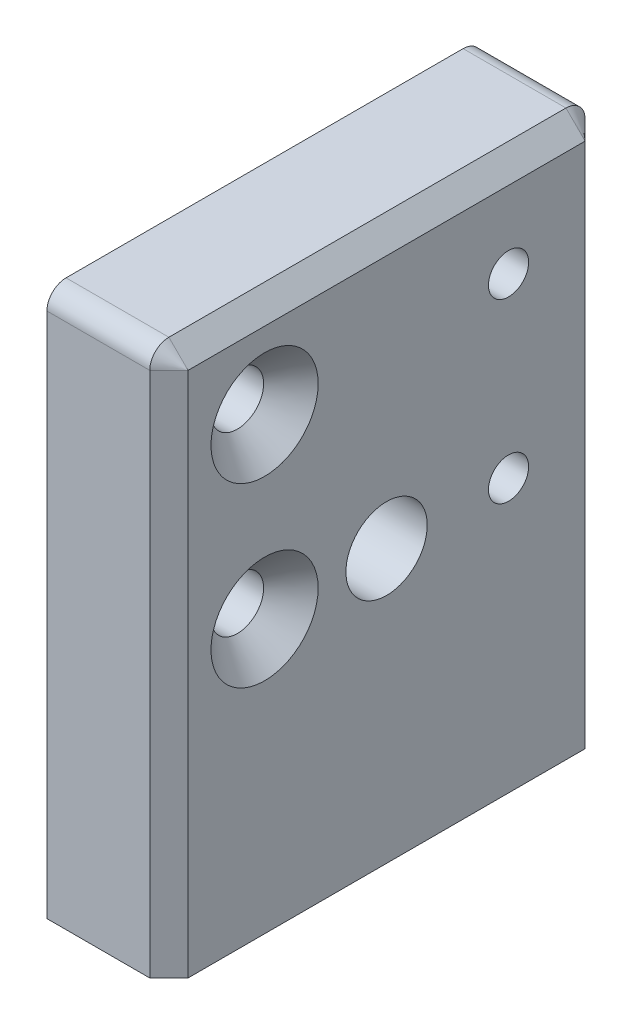
ISO-10303-21;
HEADER;
FILE_DESCRIPTION(('STEP AP214'),'2;1');
FILE_NAME('part.step','',(''),(''),'','','');
FILE_SCHEMA(('AUTOMOTIVE_DESIGN { 1 0 10303 214 1 1 1 1 }'));
ENDSEC;
DATA;
#1=APPLICATION_CONTEXT('core data for automotive mechanical design processes');
#2=APPLICATION_PROTOCOL_DEFINITION('international standard','automotive_design',2000,#1);
#3=PRODUCT_CONTEXT('',#1,'mechanical');
#4=PRODUCT('Part','Part','',(#3));
#5=PRODUCT_RELATED_PRODUCT_CATEGORY('part','',(#4));
#6=PRODUCT_DEFINITION_FORMATION('','',#4);
#7=PRODUCT_DEFINITION_CONTEXT('part definition',#1,'design');
#8=PRODUCT_DEFINITION('design','',#6,#7);
#9=PRODUCT_DEFINITION_SHAPE('','',#8);
#10=(LENGTH_UNIT() NAMED_UNIT(*) SI_UNIT(.MILLI.,.METRE.));
#11=(NAMED_UNIT(*) PLANE_ANGLE_UNIT() SI_UNIT($,.RADIAN.));
#12=(NAMED_UNIT(*) SI_UNIT($,.STERADIAN.) SOLID_ANGLE_UNIT());
#13=UNCERTAINTY_MEASURE_WITH_UNIT(LENGTH_MEASURE(1.E-05),#10,'distance_accuracy_value','');
#14=(GEOMETRIC_REPRESENTATION_CONTEXT(3) GLOBAL_UNCERTAINTY_ASSIGNED_CONTEXT((#13)) GLOBAL_UNIT_ASSIGNED_CONTEXT((#10,
#11,#12)) REPRESENTATION_CONTEXT('',''));
#15=CARTESIAN_POINT('',(0.,0.,0.));
#16=DIRECTION('',(0.,0.,1.));
#17=DIRECTION('',(1.,0.,0.));
#18=AXIS2_PLACEMENT_3D('',#15,#16,#17);
#19=CARTESIAN_POINT('',(6.375,-13.5000000000218,13.));
#20=DIRECTION('',(0.,-1.,0.));
#21=DIRECTION('',(0.,0.,-1.));
#22=AXIS2_PLACEMENT_3D('',#19,#20,#21);
#23=CONICAL_SURFACE('',#22,2.10000000000763,1.02974425864056);
#24=CARTESIAN_POINT('',(6.375,-12.2381927000106,13.));
#25=VERTEX_POINT('',#24);
#26=VERTEX_LOOP('',#25);
#27=FACE_BOUND('',#26,.T.);
#28=CARTESIAN_POINT('',(6.375,-13.5,13.));
#29=DIRECTION('',(0.,-1.,0.));
#30=DIRECTION('',(0.,0.,-1.));
#31=AXIS2_PLACEMENT_3D('',#28,#29,#30);
#32=CIRCLE('',#31,2.09999999999999);
#33=CARTESIAN_POINT('',(6.375,-13.5,10.9));
#34=VERTEX_POINT('',#33);
#35=EDGE_CURVE('E106',#34,#34,#32,.T.);
#36=ORIENTED_EDGE('',*,*,#35,.T.);
#37=EDGE_LOOP('',(#36));
#38=FACE_BOUND('',#37,.T.);
#39=ADVANCED_FACE('F17',(#27,#38),#23,.F.);
#40=CARTESIAN_POINT('',(6.375,-13.5000000000218,-13.));
#41=DIRECTION('',(0.,-1.,0.));
#42=DIRECTION('',(0.,0.,-1.));
#43=AXIS2_PLACEMENT_3D('',#40,#41,#42);
#44=CONICAL_SURFACE('',#43,2.10000000001809,1.0297442586746);
#45=CARTESIAN_POINT('',(6.375,-12.2381927000674,-13.));
#46=VERTEX_POINT('',#45);
#47=VERTEX_LOOP('',#46);
#48=FACE_BOUND('',#47,.T.);
#49=CARTESIAN_POINT('',(6.375,-13.5,-13.));
#50=DIRECTION('',(0.,-1.,0.));
#51=DIRECTION('',(0.,0.,-1.));
#52=AXIS2_PLACEMENT_3D('',#49,#50,#51);
#53=CIRCLE('',#52,2.09999999999999);
#54=CARTESIAN_POINT('',(6.375,-13.5,-15.1));
#55=VERTEX_POINT('',#54);
#56=EDGE_CURVE('E108',#55,#55,#53,.T.);
#57=ORIENTED_EDGE('',*,*,#56,.T.);
#58=EDGE_LOOP('',(#57));
#59=FACE_BOUND('',#58,.T.);
#60=ADVANCED_FACE('F103',(#48,#59),#44,.F.);
#61=CARTESIAN_POINT('',(12.75,26.5,0.));
#62=DIRECTION('',(-0.707106781186546,-0.707106781186549,0.));
#63=DIRECTION('',(0.707106781186549,-0.707106781186546,0.));
#64=AXIS2_PLACEMENT_3D('',#61,#62,#63);
#65=PLANE('',#64);
#66=DIRECTION('',(0.,0.,-1.));
#67=VECTOR('',#66,1.);
#68=CARTESIAN_POINT('',(10.75,28.5,-22.75));
#69=LINE('',#68,#67);
#70=CARTESIAN_POINT('',(10.7500000000075,28.4999999999736,-20.75));
#71=VERTEX_POINT('',#70);
#72=CARTESIAN_POINT('',(10.7500000000217,28.4999999999594,20.75));
#73=VERTEX_POINT('',#72);
#74=EDGE_CURVE('E151',#71,#73,#69,.F.);
#75=ORIENTED_EDGE('',*,*,#74,.T.);
#76=DIRECTION('',(0.707106781186549,-0.707106781186546,0.));
#77=VECTOR('',#76,1.);
#78=CARTESIAN_POINT('',(-498966.500000002,499005.75,20.7500000000306));
#79=LINE('',#78,#77);
#80=CARTESIAN_POINT('',(12.7499999999629,26.4999999999997,20.7500000000052));
#81=VERTEX_POINT('',#80);
#82=EDGE_CURVE('E164',#81,#73,#79,.F.);
#83=ORIENTED_EDGE('',*,*,#82,.F.);
#84=DIRECTION('',(0.,0.,1.));
#85=VECTOR('',#84,1.);
#86=CARTESIAN_POINT('',(12.75,26.5,0.));
#87=LINE('',#86,#85);
#88=CARTESIAN_POINT('',(12.7500000000241,26.499999999957,-20.75));
#89=VERTEX_POINT('',#88);
#90=EDGE_CURVE('E161',#81,#89,#87,.F.);
#91=ORIENTED_EDGE('',*,*,#90,.T.);
#92=DIRECTION('',(0.707106781186549,-0.707106781186546,0.));
#93=VECTOR('',#92,1.);
#94=CARTESIAN_POINT('',(-499000.,499039.249999998,-20.7499999999694));
#95=LINE('',#94,#93);
#96=EDGE_CURVE('E109',#71,#89,#95,.T.);
#97=ORIENTED_EDGE('',*,*,#96,.F.);
#98=EDGE_LOOP('',(#75,#83,#91,#97));
#99=FACE_BOUND('',#98,.T.);
#100=ADVANCED_FACE('F224',(#99),#65,.F.);
#101=CARTESIAN_POINT('',(10.75000000003,26.5,-20.75));
#102=DIRECTION('',(-1.,0.,0.));
#103=DIRECTION('',(0.,0.,1.));
#104=AXIS2_PLACEMENT_3D('',#101,#102,#103);
#105=CONICAL_SURFACE('',#104,1.99999999987494,0.785398163301719);
#106=ORIENTED_EDGE('',*,*,#96,.T.);
#107=DIRECTION('',(0.707106781186549,0.,0.707106781186546));
#108=VECTOR('',#107,1.);
#109=CARTESIAN_POINT('',(12.75,26.5,-20.75));
#110=LINE('',#109,#108);
#111=CARTESIAN_POINT('',(10.75,26.5,-22.75));
#112=VERTEX_POINT('',#111);
#113=EDGE_CURVE('E112',#89,#112,#110,.F.);
#114=ORIENTED_EDGE('',*,*,#113,.T.);
#115=CARTESIAN_POINT('',(10.75,26.5,-20.75));
#116=DIRECTION('',(-1.,0.,0.));
#117=DIRECTION('',(0.,0.,1.));
#118=AXIS2_PLACEMENT_3D('',#115,#116,#117);
#119=CIRCLE('',#118,2.);
#120=EDGE_CURVE('E195',#71,#112,#119,.T.);
#121=ORIENTED_EDGE('',*,*,#120,.F.);
#122=EDGE_LOOP('',(#106,#114,#121));
#123=FACE_BOUND('',#122,.T.);
#124=ADVANCED_FACE('F485',(#123),#105,.T.);
#125=CARTESIAN_POINT('',(6.375,-28.5,13.));
#126=DIRECTION('',(0.,-1.,0.));
#127=DIRECTION('',(0.,0.,-1.));
#128=AXIS2_PLACEMENT_3D('',#125,#126,#127);
#129=CYLINDRICAL_SURFACE('',#128,2.09999999999999);
#130=ORIENTED_EDGE('',*,*,#35,.F.);
#131=EDGE_LOOP('',(#130));
#132=FACE_BOUND('',#131,.T.);
#133=CARTESIAN_POINT('',(6.375,-28.5,13.));
#134=DIRECTION('',(0.,-1.,0.));
#135=DIRECTION('',(0.,0.,-1.));
#136=AXIS2_PLACEMENT_3D('',#133,#134,#135);
#137=CIRCLE('',#136,2.09999999999999);
#138=CARTESIAN_POINT('',(6.375,-28.5,10.9));
#139=VERTEX_POINT('',#138);
#140=EDGE_CURVE('E145',#139,#139,#137,.T.);
#141=ORIENTED_EDGE('',*,*,#140,.T.);
#142=EDGE_LOOP('',(#141));
#143=FACE_BOUND('',#142,.T.);
#144=ADVANCED_FACE('F476',(#132,#143),#129,.F.);
#145=CARTESIAN_POINT('',(6.375,-28.5,-13.));
#146=DIRECTION('',(0.,-1.,0.));
#147=DIRECTION('',(0.,0.,-1.));
#148=AXIS2_PLACEMENT_3D('',#145,#146,#147);
#149=CYLINDRICAL_SURFACE('',#148,2.09999999999999);
#150=ORIENTED_EDGE('',*,*,#56,.F.);
#151=EDGE_LOOP('',(#150));
#152=FACE_BOUND('',#151,.T.);
#153=CARTESIAN_POINT('',(6.375,-28.5,-13.));
#154=DIRECTION('',(0.,-1.,0.));
#155=DIRECTION('',(0.,0.,-1.));
#156=AXIS2_PLACEMENT_3D('',#153,#154,#155);
#157=CIRCLE('',#156,2.09999999999999);
#158=CARTESIAN_POINT('',(6.375,-28.5,-15.1));
#159=VERTEX_POINT('',#158);
#160=EDGE_CURVE('E141',#159,#159,#157,.T.);
#161=ORIENTED_EDGE('',*,*,#160,.T.);
#162=EDGE_LOOP('',(#161));
#163=FACE_BOUND('',#162,.T.);
#164=ADVANCED_FACE('F468',(#152,#163),#149,.F.);
#165=CARTESIAN_POINT('',(12.75,0.,-20.75));
#166=DIRECTION('',(-0.707106781186546,0.,0.707106781186549));
#167=DIRECTION('',(0.707106781186549,0.,0.707106781186546));
#168=AXIS2_PLACEMENT_3D('',#165,#166,#167);
#169=PLANE('',#168);
#170=DIRECTION('',(0.,-1.,0.));
#171=VECTOR('',#170,1.);
#172=CARTESIAN_POINT('',(10.75,28.5,-22.75));
#173=LINE('',#172,#171);
#174=CARTESIAN_POINT('',(10.75,-28.5,-22.75));
#175=VERTEX_POINT('',#174);
#176=EDGE_CURVE('E192',#175,#112,#173,.F.);
#177=ORIENTED_EDGE('',*,*,#176,.T.);
#178=ORIENTED_EDGE('',*,*,#113,.F.);
#179=DIRECTION('',(0.,1.,0.));
#180=VECTOR('',#179,1.);
#181=CARTESIAN_POINT('',(12.75,0.,-20.75));
#182=LINE('',#181,#180);
#183=CARTESIAN_POINT('',(12.75,-28.5,-20.75));
#184=VERTEX_POINT('',#183);
#185=EDGE_CURVE('E154',#89,#184,#182,.F.);
#186=ORIENTED_EDGE('',*,*,#185,.T.);
#187=DIRECTION('',(-0.707106781186549,0.,-0.707106781186546));
#188=VECTOR('',#187,1.);
#189=CARTESIAN_POINT('',(12.75,-28.5,-20.75));
#190=LINE('',#189,#188);
#191=EDGE_CURVE('E198',#184,#175,#190,.T.);
#192=ORIENTED_EDGE('',*,*,#191,.T.);
#193=EDGE_LOOP('',(#177,#178,#186,#192));
#194=FACE_BOUND('',#193,.T.);
#195=ADVANCED_FACE('F229',(#194),#169,.F.);
#196=CARTESIAN_POINT('',(12.75,0.,20.75));
#197=DIRECTION('',(-0.707106781186546,0.,-0.707106781186549));
#198=DIRECTION('',(-0.707106781186549,0.,0.707106781186546));
#199=AXIS2_PLACEMENT_3D('',#196,#197,#198);
#200=PLANE('',#199);
#201=DIRECTION('',(0.,1.,0.));
#202=VECTOR('',#201,1.);
#203=CARTESIAN_POINT('',(10.75,28.5,22.75));
#204=LINE('',#203,#202);
#205=CARTESIAN_POINT('',(10.7500000000217,26.5,22.749999999965));
#206=VERTEX_POINT('',#205);
#207=CARTESIAN_POINT('',(10.75,-28.5,22.75));
#208=VERTEX_POINT('',#207);
#209=EDGE_CURVE('E183',#206,#208,#204,.F.);
#210=ORIENTED_EDGE('',*,*,#209,.T.);
#211=DIRECTION('',(0.707106781186549,0.,-0.707106781186546));
#212=VECTOR('',#211,1.);
#213=CARTESIAN_POINT('',(10.75,-28.5,22.75));
#214=LINE('',#213,#212);
#215=CARTESIAN_POINT('',(12.75,-28.5,20.75));
#216=VERTEX_POINT('',#215);
#217=EDGE_CURVE('E144',#208,#216,#214,.T.);
#218=ORIENTED_EDGE('',*,*,#217,.T.);
#219=DIRECTION('',(0.,1.,0.));
#220=VECTOR('',#219,1.);
#221=CARTESIAN_POINT('',(12.75,0.,20.75));
#222=LINE('',#221,#220);
#223=EDGE_CURVE('E157',#216,#81,#222,.T.);
#224=ORIENTED_EDGE('',*,*,#223,.T.);
#225=DIRECTION('',(0.707106781186549,0.,-0.707106781186546));
#226=VECTOR('',#225,1.);
#227=CARTESIAN_POINT('',(-498966.500000002,26.5,499000.));
#228=LINE('',#227,#226);
#229=EDGE_CURVE('E168',#206,#81,#228,.T.);
#230=ORIENTED_EDGE('',*,*,#229,.F.);
#231=EDGE_LOOP('',(#210,#218,#224,#230));
#232=FACE_BOUND('',#231,.T.);
#233=ADVANCED_FACE('F295',(#232),#200,.F.);
#234=CARTESIAN_POINT('',(10.7500000000869,26.5,20.75));
#235=DIRECTION('',(-1.,0.,0.));
#236=DIRECTION('',(0.,0.,1.));
#237=AXIS2_PLACEMENT_3D('',#234,#235,#236);
#238=CONICAL_SURFACE('',#237,1.99999999985993,0.785398163397448);
#239=ORIENTED_EDGE('',*,*,#229,.T.);
#240=ORIENTED_EDGE('',*,*,#82,.T.);
#241=CARTESIAN_POINT('',(10.75,26.5,20.75));
#242=DIRECTION('',(-1.,0.,0.));
#243=DIRECTION('',(0.,0.,1.));
#244=AXIS2_PLACEMENT_3D('',#241,#242,#243);
#245=CIRCLE('',#244,2.);
#246=EDGE_CURVE('E260',#206,#73,#245,.T.);
#247=ORIENTED_EDGE('',*,*,#246,.F.);
#248=EDGE_LOOP('',(#239,#240,#247));
#249=FACE_BOUND('',#248,.T.);
#250=ADVANCED_FACE('F296',(#249),#238,.T.);
#251=CARTESIAN_POINT('',(12.7500000000964,0.,12.75));
#252=DIRECTION('',(1.,0.,0.));
#253=DIRECTION('',(0.,0.,-1.));
#254=AXIS2_PLACEMENT_3D('',#251,#252,#253);
#255=CONICAL_SURFACE('',#254,5.6000000000895,0.785398163407421);
#256=CARTESIAN_POINT('',(12.7500000000791,0.,12.75));
#257=DIRECTION('',(1.,0.,0.));
#258=DIRECTION('',(0.,0.,-1.));
#259=AXIS2_PLACEMENT_3D('',#256,#257,#258);
#260=CIRCLE('',#259,5.60000000007221);
#261=CARTESIAN_POINT('',(12.7500000000791,0.,7.14999999992779));
#262=VERTEX_POINT('',#261);
#263=EDGE_CURVE('E155',#262,#262,#260,.T.);
#264=ORIENTED_EDGE('',*,*,#263,.T.);
#265=EDGE_LOOP('',(#264));
#266=FACE_BOUND('',#265,.T.);
#267=CARTESIAN_POINT('',(9.9,0.,12.75));
#268=DIRECTION('',(1.,0.,0.));
#269=DIRECTION('',(0.,0.,-1.));
#270=AXIS2_PLACEMENT_3D('',#267,#268,#269);
#271=CIRCLE('',#270,2.75);
#272=CARTESIAN_POINT('',(9.9,0.,10.));
#273=VERTEX_POINT('',#272);
#274=EDGE_CURVE('E254',#273,#273,#271,.F.);
#275=ORIENTED_EDGE('',*,*,#274,.T.);
#276=EDGE_LOOP('',(#275));
#277=FACE_BOUND('',#276,.T.);
#278=ADVANCED_FACE('F298',(#266,#277),#255,.F.);
#279=CARTESIAN_POINT('',(12.7500000000964,18.5,12.75));
#280=DIRECTION('',(1.,0.,0.));
#281=DIRECTION('',(0.,0.,-1.));
#282=AXIS2_PLACEMENT_3D('',#279,#280,#281);
#283=CONICAL_SURFACE('',#282,5.6000000000895,0.785398163407421);
#284=CARTESIAN_POINT('',(12.7500000000791,18.5,12.75));
#285=DIRECTION('',(1.,0.,0.));
#286=DIRECTION('',(0.,0.,-1.));
#287=AXIS2_PLACEMENT_3D('',#284,#285,#286);
#288=CIRCLE('',#287,5.60000000007221);
#289=CARTESIAN_POINT('',(12.7500000000791,18.5,7.14999999992779));
#290=VERTEX_POINT('',#289);
#291=EDGE_CURVE('E20',#290,#290,#288,.T.);
#292=ORIENTED_EDGE('',*,*,#291,.T.);
#293=EDGE_LOOP('',(#292));
#294=FACE_BOUND('',#293,.T.);
#295=CARTESIAN_POINT('',(9.9,18.5,12.75));
#296=DIRECTION('',(1.,0.,0.));
#297=DIRECTION('',(0.,0.,-1.));
#298=AXIS2_PLACEMENT_3D('',#295,#296,#297);
#299=CIRCLE('',#298,2.75);
#300=CARTESIAN_POINT('',(9.9,18.5,10.));
#301=VERTEX_POINT('',#300);
#302=EDGE_CURVE('E140',#301,#301,#299,.F.);
#303=ORIENTED_EDGE('',*,*,#302,.T.);
#304=EDGE_LOOP('',(#303));
#305=FACE_BOUND('',#304,.T.);
#306=ADVANCED_FACE('F305',(#294,#305),#283,.F.);
#307=CARTESIAN_POINT('',(12.75,0.,0.));
#308=DIRECTION('',(-1.,0.,0.));
#309=DIRECTION('',(0.,0.,1.));
#310=AXIS2_PLACEMENT_3D('',#307,#308,#309);
#311=PLANE('',#310);
#312=ORIENTED_EDGE('',*,*,#185,.F.);
#313=ORIENTED_EDGE('',*,*,#90,.F.);
#314=ORIENTED_EDGE('',*,*,#223,.F.);
#315=DIRECTION('',(0.,0.,1.));
#316=VECTOR('',#315,1.);
#317=CARTESIAN_POINT('',(12.75,-28.5,-22.75));
#318=LINE('',#317,#316);
#319=EDGE_CURVE('E189',#216,#184,#318,.F.);
#320=ORIENTED_EDGE('',*,*,#319,.T.);
#321=EDGE_LOOP('',(#312,#313,#314,#320));
#322=FACE_BOUND('',#321,.T.);
#323=ORIENTED_EDGE('',*,*,#263,.F.);
#324=EDGE_LOOP('',(#323));
#325=FACE_BOUND('',#324,.T.);
#326=ORIENTED_EDGE('',*,*,#291,.F.);
#327=EDGE_LOOP('',(#326));
#328=FACE_BOUND('',#327,.T.);
#329=CARTESIAN_POINT('',(12.75,0.,-12.75));
#330=DIRECTION('',(1.,0.,0.));
#331=DIRECTION('',(0.,0.,-1.));
#332=AXIS2_PLACEMENT_3D('',#329,#330,#331);
#333=CIRCLE('',#332,2.1);
#334=CARTESIAN_POINT('',(12.75,0.,-14.85));
#335=VERTEX_POINT('',#334);
#336=EDGE_CURVE('E137',#335,#335,#333,.F.);
#337=ORIENTED_EDGE('',*,*,#336,.T.);
#338=EDGE_LOOP('',(#337));
#339=FACE_BOUND('',#338,.T.);
#340=CARTESIAN_POINT('',(12.75,18.5,-12.75));
#341=DIRECTION('',(1.,0.,0.));
#342=DIRECTION('',(0.,0.,-1.));
#343=AXIS2_PLACEMENT_3D('',#340,#341,#342);
#344=CIRCLE('',#343,2.1);
#345=CARTESIAN_POINT('',(12.75,18.5,-14.85));
#346=VERTEX_POINT('',#345);
#347=EDGE_CURVE('E148',#346,#346,#344,.F.);
#348=ORIENTED_EDGE('',*,*,#347,.T.);
#349=EDGE_LOOP('',(#348));
#350=FACE_BOUND('',#349,.T.);
#351=CARTESIAN_POINT('',(12.75,0.,0.));
#352=DIRECTION('',(1.,0.,0.));
#353=DIRECTION('',(0.,0.,-1.));
#354=AXIS2_PLACEMENT_3D('',#351,#352,#353);
#355=CIRCLE('',#354,4.25);
#356=CARTESIAN_POINT('',(12.75,0.,-4.25000000000001));
#357=VERTEX_POINT('',#356);
#358=EDGE_CURVE('E152',#357,#357,#355,.F.);
#359=ORIENTED_EDGE('',*,*,#358,.T.);
#360=EDGE_LOOP('',(#359));
#361=FACE_BOUND('',#360,.T.);
#362=ADVANCED_FACE('F232',(#322,#325,#328,#339,#350,#361),#311,.F.);
#363=CARTESIAN_POINT('',(0.,0.,0.));
#364=DIRECTION('',(1.,0.,0.));
#365=DIRECTION('',(0.,0.,-1.));
#366=AXIS2_PLACEMENT_3D('',#363,#364,#365);
#367=CYLINDRICAL_SURFACE('',#366,4.25);
#368=ORIENTED_EDGE('',*,*,#358,.F.);
#369=EDGE_LOOP('',(#368));
#370=FACE_BOUND('',#369,.T.);
#371=CARTESIAN_POINT('',(0.,0.,0.));
#372=DIRECTION('',(1.,0.,0.));
#373=DIRECTION('',(0.,0.,-1.));
#374=AXIS2_PLACEMENT_3D('',#371,#372,#373);
#375=CIRCLE('',#374,4.25);
#376=CARTESIAN_POINT('',(0.,0.,-4.25000000000001));
#377=VERTEX_POINT('',#376);
#378=EDGE_CURVE('E134',#377,#377,#375,.T.);
#379=ORIENTED_EDGE('',*,*,#378,.F.);
#380=EDGE_LOOP('',(#379));
#381=FACE_BOUND('',#380,.T.);
#382=ADVANCED_FACE('F343',(#370,#381),#367,.F.);
#383=CARTESIAN_POINT('',(12.75,18.5,-12.75));
#384=DIRECTION('',(1.,0.,0.));
#385=DIRECTION('',(0.,0.,-1.));
#386=AXIS2_PLACEMENT_3D('',#383,#384,#385);
#387=CYLINDRICAL_SURFACE('',#386,2.1);
#388=ORIENTED_EDGE('',*,*,#347,.F.);
#389=EDGE_LOOP('',(#388));
#390=FACE_BOUND('',#389,.T.);
#391=CARTESIAN_POINT('',(0.,18.5,-12.75));
#392=DIRECTION('',(1.,0.,0.));
#393=DIRECTION('',(0.,0.,-1.));
#394=AXIS2_PLACEMENT_3D('',#391,#392,#393);
#395=CIRCLE('',#394,2.1);
#396=CARTESIAN_POINT('',(0.,18.5,-14.85));
#397=VERTEX_POINT('',#396);
#398=EDGE_CURVE('E131',#397,#397,#395,.T.);
#399=ORIENTED_EDGE('',*,*,#398,.F.);
#400=EDGE_LOOP('',(#399));
#401=FACE_BOUND('',#400,.T.);
#402=ADVANCED_FACE('F340',(#390,#401),#387,.F.);
#403=CARTESIAN_POINT('',(12.75,28.5,-22.75));
#404=DIRECTION('',(0.,-1.,0.));
#405=DIRECTION('',(0.,0.,-1.));
#406=AXIS2_PLACEMENT_3D('',#403,#404,#405);
#407=PLANE('',#406);
#408=ORIENTED_EDGE('',*,*,#74,.F.);
#409=DIRECTION('',(-1.,0.,0.));
#410=VECTOR('',#409,1.);
#411=CARTESIAN_POINT('',(12.75,28.5,-20.75));
#412=LINE('',#411,#410);
#413=CARTESIAN_POINT('',(0.,28.5,-20.75));
#414=VERTEX_POINT('',#413);
#415=EDGE_CURVE('E52',#414,#71,#412,.F.);
#416=ORIENTED_EDGE('',*,*,#415,.F.);
#417=DIRECTION('',(0.,0.,1.));
#418=VECTOR('',#417,1.);
#419=CARTESIAN_POINT('',(0.,28.5,0.));
#420=LINE('',#419,#418);
#421=CARTESIAN_POINT('',(0.,28.5,20.75));
#422=VERTEX_POINT('',#421);
#423=EDGE_CURVE('E130',#422,#414,#420,.F.);
#424=ORIENTED_EDGE('',*,*,#423,.F.);
#425=DIRECTION('',(-1.,0.,0.));
#426=VECTOR('',#425,1.);
#427=CARTESIAN_POINT('',(12.75,28.5,20.75));
#428=LINE('',#427,#426);
#429=EDGE_CURVE('E257',#73,#422,#428,.T.);
#430=ORIENTED_EDGE('',*,*,#429,.F.);
#431=EDGE_LOOP('',(#408,#416,#424,#430));
#432=FACE_BOUND('',#431,.T.);
#433=ADVANCED_FACE('F290',(#432),#407,.F.);
#434=CARTESIAN_POINT('',(12.75,26.5,-20.75));
#435=DIRECTION('',(-1.,0.,0.));
#436=DIRECTION('',(0.,0.,1.));
#437=AXIS2_PLACEMENT_3D('',#434,#435,#436);
#438=CYLINDRICAL_SURFACE('',#437,2.);
#439=DIRECTION('',(1.,0.,0.));
#440=VECTOR('',#439,1.);
#441=CARTESIAN_POINT('',(12.75,26.5,-22.75));
#442=LINE('',#441,#440);
#443=CARTESIAN_POINT('',(0.,26.5,-22.75));
#444=VERTEX_POINT('',#443);
#445=EDGE_CURVE('E58',#112,#444,#442,.F.);
#446=ORIENTED_EDGE('',*,*,#445,.T.);
#447=CARTESIAN_POINT('',(0.,26.5,-20.75));
#448=DIRECTION('',(-1.,0.,0.));
#449=DIRECTION('',(0.,0.,1.));
#450=AXIS2_PLACEMENT_3D('',#447,#448,#449);
#451=CIRCLE('',#450,2.);
#452=EDGE_CURVE('E126',#414,#444,#451,.T.);
#453=ORIENTED_EDGE('',*,*,#452,.F.);
#454=ORIENTED_EDGE('',*,*,#415,.T.);
#455=ORIENTED_EDGE('',*,*,#120,.T.);
#456=EDGE_LOOP('',(#446,#453,#454,#455));
#457=FACE_BOUND('',#456,.T.);
#458=ADVANCED_FACE('F335',(#457),#438,.T.);
#459=CARTESIAN_POINT('',(12.75,28.5,-22.75));
#460=DIRECTION('',(0.,0.,1.));
#461=DIRECTION('',(0.,-1.,0.));
#462=AXIS2_PLACEMENT_3D('',#459,#460,#461);
#463=PLANE('',#462);
#464=ORIENTED_EDGE('',*,*,#176,.F.);
#465=DIRECTION('',(1.,0.,0.));
#466=VECTOR('',#465,1.);
#467=CARTESIAN_POINT('',(12.75,-28.5,-22.75));
#468=LINE('',#467,#466);
#469=CARTESIAN_POINT('',(0.,-28.5,-22.75));
#470=VERTEX_POINT('',#469);
#471=EDGE_CURVE('E65',#175,#470,#468,.F.);
#472=ORIENTED_EDGE('',*,*,#471,.T.);
#473=DIRECTION('',(0.,1.,0.));
#474=VECTOR('',#473,1.);
#475=CARTESIAN_POINT('',(0.,0.,-22.75));
#476=LINE('',#475,#474);
#477=EDGE_CURVE('E129',#444,#470,#476,.F.);
#478=ORIENTED_EDGE('',*,*,#477,.F.);
#479=ORIENTED_EDGE('',*,*,#445,.F.);
#480=EDGE_LOOP('',(#464,#472,#478,#479));
#481=FACE_BOUND('',#480,.T.);
#482=ADVANCED_FACE('F240',(#481),#463,.F.);
#483=CARTESIAN_POINT('',(12.75,-28.5,-22.75));
#484=DIRECTION('',(0.,1.,0.));
#485=DIRECTION('',(0.,0.,1.));
#486=AXIS2_PLACEMENT_3D('',#483,#484,#485);
#487=PLANE('',#486);
#488=ORIENTED_EDGE('',*,*,#191,.F.);
#489=ORIENTED_EDGE('',*,*,#319,.F.);
#490=ORIENTED_EDGE('',*,*,#217,.F.);
#491=DIRECTION('',(1.,0.,0.));
#492=VECTOR('',#491,1.);
#493=CARTESIAN_POINT('',(12.75,-28.5,22.75));
#494=LINE('',#493,#492);
#495=CARTESIAN_POINT('',(0.,-28.5,22.75));
#496=VERTEX_POINT('',#495);
#497=EDGE_CURVE('E185',#208,#496,#494,.F.);
#498=ORIENTED_EDGE('',*,*,#497,.T.);
#499=DIRECTION('',(0.,0.,1.));
#500=VECTOR('',#499,1.);
#501=CARTESIAN_POINT('',(0.,-28.5,0.));
#502=LINE('',#501,#500);
#503=EDGE_CURVE('E274',#470,#496,#502,.T.);
#504=ORIENTED_EDGE('',*,*,#503,.F.);
#505=ORIENTED_EDGE('',*,*,#471,.F.);
#506=EDGE_LOOP('',(#488,#489,#490,#498,#504,#505));
#507=FACE_BOUND('',#506,.T.);
#508=ORIENTED_EDGE('',*,*,#160,.F.);
#509=EDGE_LOOP('',(#508));
#510=FACE_BOUND('',#509,.T.);
#511=ORIENTED_EDGE('',*,*,#140,.F.);
#512=EDGE_LOOP('',(#511));
#513=FACE_BOUND('',#512,.T.);
#514=ADVANCED_FACE('F238',(#507,#510,#513),#487,.F.);
#515=CARTESIAN_POINT('',(12.75,28.5,22.75));
#516=DIRECTION('',(0.,0.,-1.));
#517=DIRECTION('',(0.,1.,0.));
#518=AXIS2_PLACEMENT_3D('',#515,#516,#517);
#519=PLANE('',#518);
#520=ORIENTED_EDGE('',*,*,#209,.F.);
#521=DIRECTION('',(-1.,0.,0.));
#522=VECTOR('',#521,1.);
#523=CARTESIAN_POINT('',(12.75,26.5,22.75));
#524=LINE('',#523,#522);
#525=CARTESIAN_POINT('',(0.,26.5,22.75));
#526=VERTEX_POINT('',#525);
#527=EDGE_CURVE('E35',#526,#206,#524,.F.);
#528=ORIENTED_EDGE('',*,*,#527,.F.);
#529=DIRECTION('',(0.,1.,0.));
#530=VECTOR('',#529,1.);
#531=CARTESIAN_POINT('',(0.,0.,22.75));
#532=LINE('',#531,#530);
#533=EDGE_CURVE('E125',#496,#526,#532,.T.);
#534=ORIENTED_EDGE('',*,*,#533,.F.);
#535=ORIENTED_EDGE('',*,*,#497,.F.);
#536=EDGE_LOOP('',(#520,#528,#534,#535));
#537=FACE_BOUND('',#536,.T.);
#538=ADVANCED_FACE('F293',(#537),#519,.F.);
#539=CARTESIAN_POINT('',(12.75,26.5,20.75));
#540=DIRECTION('',(-1.,0.,0.));
#541=DIRECTION('',(0.,0.,1.));
#542=AXIS2_PLACEMENT_3D('',#539,#540,#541);
#543=CYLINDRICAL_SURFACE('',#542,2.);
#544=ORIENTED_EDGE('',*,*,#429,.T.);
#545=CARTESIAN_POINT('',(0.,26.5,20.75));
#546=DIRECTION('',(-1.,0.,0.));
#547=DIRECTION('',(0.,0.,1.));
#548=AXIS2_PLACEMENT_3D('',#545,#546,#547);
#549=CIRCLE('',#548,2.);
#550=EDGE_CURVE('E122',#526,#422,#549,.T.);
#551=ORIENTED_EDGE('',*,*,#550,.F.);
#552=ORIENTED_EDGE('',*,*,#527,.T.);
#553=ORIENTED_EDGE('',*,*,#246,.T.);
#554=EDGE_LOOP('',(#544,#551,#552,#553));
#555=FACE_BOUND('',#554,.T.);
#556=ADVANCED_FACE('F291',(#555),#543,.T.);
#557=CARTESIAN_POINT('',(12.75,0.,12.75));
#558=DIRECTION('',(1.,0.,0.));
#559=DIRECTION('',(0.,0.,-1.));
#560=AXIS2_PLACEMENT_3D('',#557,#558,#559);
#561=CYLINDRICAL_SURFACE('',#560,2.75);
#562=ORIENTED_EDGE('',*,*,#274,.F.);
#563=EDGE_LOOP('',(#562));
#564=FACE_BOUND('',#563,.T.);
#565=CARTESIAN_POINT('',(0.,0.,12.75));
#566=DIRECTION('',(1.,0.,0.));
#567=DIRECTION('',(0.,0.,-1.));
#568=AXIS2_PLACEMENT_3D('',#565,#566,#567);
#569=CIRCLE('',#568,2.75);
#570=CARTESIAN_POINT('',(0.,0.,10.));
#571=VERTEX_POINT('',#570);
#572=EDGE_CURVE('E119',#571,#571,#569,.T.);
#573=ORIENTED_EDGE('',*,*,#572,.F.);
#574=EDGE_LOOP('',(#573));
#575=FACE_BOUND('',#574,.T.);
#576=ADVANCED_FACE('F322',(#564,#575),#561,.F.);
#577=CARTESIAN_POINT('',(12.75,18.5,12.75));
#578=DIRECTION('',(1.,0.,0.));
#579=DIRECTION('',(0.,0.,-1.));
#580=AXIS2_PLACEMENT_3D('',#577,#578,#579);
#581=CYLINDRICAL_SURFACE('',#580,2.75);
#582=ORIENTED_EDGE('',*,*,#302,.F.);
#583=EDGE_LOOP('',(#582));
#584=FACE_BOUND('',#583,.T.);
#585=CARTESIAN_POINT('',(0.,18.5,12.75));
#586=DIRECTION('',(1.,0.,0.));
#587=DIRECTION('',(0.,0.,-1.));
#588=AXIS2_PLACEMENT_3D('',#585,#586,#587);
#589=CIRCLE('',#588,2.75);
#590=CARTESIAN_POINT('',(0.,18.5,10.));
#591=VERTEX_POINT('',#590);
#592=EDGE_CURVE('E26',#591,#591,#589,.T.);
#593=ORIENTED_EDGE('',*,*,#592,.F.);
#594=EDGE_LOOP('',(#593));
#595=FACE_BOUND('',#594,.T.);
#596=ADVANCED_FACE('F315',(#584,#595),#581,.F.);
#597=CARTESIAN_POINT('',(12.75,0.,-12.75));
#598=DIRECTION('',(1.,0.,0.));
#599=DIRECTION('',(0.,0.,-1.));
#600=AXIS2_PLACEMENT_3D('',#597,#598,#599);
#601=CYLINDRICAL_SURFACE('',#600,2.1);
#602=ORIENTED_EDGE('',*,*,#336,.F.);
#603=EDGE_LOOP('',(#602));
#604=FACE_BOUND('',#603,.T.);
#605=CARTESIAN_POINT('',(0.,0.,-12.75));
#606=DIRECTION('',(1.,0.,0.));
#607=DIRECTION('',(0.,0.,-1.));
#608=AXIS2_PLACEMENT_3D('',#605,#606,#607);
#609=CIRCLE('',#608,2.1);
#610=CARTESIAN_POINT('',(0.,0.,-14.85));
#611=VERTEX_POINT('',#610);
#612=EDGE_CURVE('E11',#611,#611,#609,.T.);
#613=ORIENTED_EDGE('',*,*,#612,.F.);
#614=EDGE_LOOP('',(#613));
#615=FACE_BOUND('',#614,.T.);
#616=ADVANCED_FACE('F309',(#604,#615),#601,.F.);
#617=CARTESIAN_POINT('',(0.,0.,0.));
#618=DIRECTION('',(-1.,0.,0.));
#619=DIRECTION('',(0.,0.,1.));
#620=AXIS2_PLACEMENT_3D('',#617,#618,#619);
#621=PLANE('',#620);
#622=ORIENTED_EDGE('',*,*,#612,.T.);
#623=EDGE_LOOP('',(#622));
#624=FACE_BOUND('',#623,.T.);
#625=ORIENTED_EDGE('',*,*,#592,.T.);
#626=EDGE_LOOP('',(#625));
#627=FACE_BOUND('',#626,.T.);
#628=ORIENTED_EDGE('',*,*,#572,.T.);
#629=EDGE_LOOP('',(#628));
#630=FACE_BOUND('',#629,.T.);
#631=ORIENTED_EDGE('',*,*,#533,.T.);
#632=ORIENTED_EDGE('',*,*,#550,.T.);
#633=ORIENTED_EDGE('',*,*,#423,.T.);
#634=ORIENTED_EDGE('',*,*,#452,.T.);
#635=ORIENTED_EDGE('',*,*,#477,.T.);
#636=ORIENTED_EDGE('',*,*,#503,.T.);
#637=EDGE_LOOP('',(#631,#632,#633,#634,#635,#636));
#638=FACE_BOUND('',#637,.T.);
#639=ORIENTED_EDGE('',*,*,#398,.T.);
#640=EDGE_LOOP('',(#639));
#641=FACE_BOUND('',#640,.T.);
#642=ORIENTED_EDGE('',*,*,#378,.T.);
#643=EDGE_LOOP('',(#642));
#644=FACE_BOUND('',#643,.T.);
#645=ADVANCED_FACE('F288',(#624,#627,#630,#638,#641,#644),#621,.T.);
#646=CLOSED_SHELL('',(#39,#60,#100,#124,#144,#164,#195,#233,#250,#278,#306,#362,#382,#402,#433,
#458,#482,#514,#538,#556,#576,#596,#616,#645));
#647=MANIFOLD_SOLID_BREP('B1',#646);
#648=ADVANCED_BREP_SHAPE_REPRESENTATION('',(#18,#647),#14);
#649=SHAPE_DEFINITION_REPRESENTATION(#9,#648);
ENDSEC;
END-ISO-10303-21;
